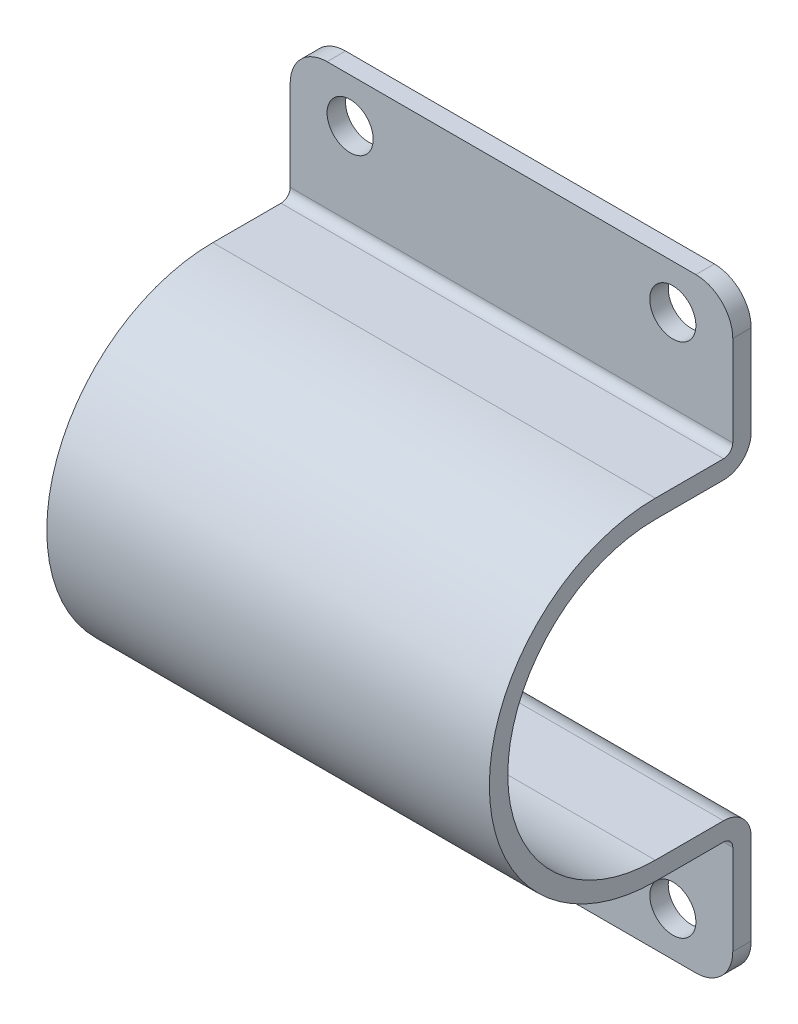
ISO-10303-21;
HEADER;
FILE_DESCRIPTION(('STEP AP214'),'2;1');
FILE_NAME('part.step','',(''),(''),'','','');
FILE_SCHEMA(('AUTOMOTIVE_DESIGN { 1 0 10303 214 1 1 1 1 }'));
ENDSEC;
DATA;
#1=APPLICATION_CONTEXT('core data for automotive mechanical design processes');
#2=APPLICATION_PROTOCOL_DEFINITION('international standard','automotive_design',2000,#1);
#3=PRODUCT_CONTEXT('',#1,'mechanical');
#4=PRODUCT('Part','Part','',(#3));
#5=PRODUCT_RELATED_PRODUCT_CATEGORY('part','',(#4));
#6=PRODUCT_DEFINITION_FORMATION('','',#4);
#7=PRODUCT_DEFINITION_CONTEXT('part definition',#1,'design');
#8=PRODUCT_DEFINITION('design','',#6,#7);
#9=PRODUCT_DEFINITION_SHAPE('','',#8);
#10=(LENGTH_UNIT() NAMED_UNIT(*) SI_UNIT(.MILLI.,.METRE.));
#11=(NAMED_UNIT(*) PLANE_ANGLE_UNIT() SI_UNIT($,.RADIAN.));
#12=(NAMED_UNIT(*) SI_UNIT($,.STERADIAN.) SOLID_ANGLE_UNIT());
#13=UNCERTAINTY_MEASURE_WITH_UNIT(LENGTH_MEASURE(1.E-05),#10,'distance_accuracy_value','');
#14=(GEOMETRIC_REPRESENTATION_CONTEXT(3) GLOBAL_UNCERTAINTY_ASSIGNED_CONTEXT((#13)) GLOBAL_UNIT_ASSIGNED_CONTEXT((#10,
#11,#12)) REPRESENTATION_CONTEXT('',''));
#15=CARTESIAN_POINT('',(0.,0.,0.));
#16=DIRECTION('',(0.,0.,1.));
#17=DIRECTION('',(1.,0.,0.));
#18=AXIS2_PLACEMENT_3D('',#15,#16,#17);
#19=CARTESIAN_POINT('',(240.,164.,10.));
#20=DIRECTION('',(0.,-1.,0.));
#21=DIRECTION('',(0.,0.,-1.));
#22=AXIS2_PLACEMENT_3D('',#19,#20,#21);
#23=PLANE('',#22);
#24=DIRECTION('',(-1.,0.,0.));
#25=VECTOR('',#24,1.);
#26=CARTESIAN_POINT('',(240.,164.,0.));
#27=LINE('',#26,#25);
#28=CARTESIAN_POINT('',(220.,164.,0.));
#29=VERTEX_POINT('',#28);
#30=CARTESIAN_POINT('',(20.,164.,0.));
#31=VERTEX_POINT('',#30);
#32=EDGE_CURVE('E234',#29,#31,#27,.T.);
#33=ORIENTED_EDGE('',*,*,#32,.T.);
#34=DIRECTION('',(0.,0.,1.));
#35=VECTOR('',#34,1.);
#36=CARTESIAN_POINT('',(20.,164.,10.));
#37=LINE('',#36,#35);
#38=CARTESIAN_POINT('',(20.,164.,10.));
#39=VERTEX_POINT('',#38);
#40=EDGE_CURVE('E324',#31,#39,#37,.T.);
#41=ORIENTED_EDGE('',*,*,#40,.T.);
#42=DIRECTION('',(-1.,0.,0.));
#43=VECTOR('',#42,1.);
#44=CARTESIAN_POINT('',(240.,164.,10.));
#45=LINE('',#44,#43);
#46=CARTESIAN_POINT('',(220.,164.,10.));
#47=VERTEX_POINT('',#46);
#48=EDGE_CURVE('E201',#47,#39,#45,.T.);
#49=ORIENTED_EDGE('',*,*,#48,.F.);
#50=DIRECTION('',(0.,0.,1.));
#51=VECTOR('',#50,1.);
#52=CARTESIAN_POINT('',(220.,164.,10.));
#53=LINE('',#52,#51);
#54=EDGE_CURVE('E63',#47,#29,#53,.F.);
#55=ORIENTED_EDGE('',*,*,#54,.T.);
#56=EDGE_LOOP('',(#33,#41,#49,#55));
#57=FACE_BOUND('',#56,.T.);
#58=ADVANCED_FACE('F43',(#57),#23,.F.);
#59=CARTESIAN_POINT('',(240.,95.,10.));
#60=DIRECTION('',(0.,0.,-1.));
#61=DIRECTION('',(-1.,0.,0.));
#62=AXIS2_PLACEMENT_3D('',#59,#60,#61);
#63=PLANE('',#62);
#64=CARTESIAN_POINT('',(207.5,140.,10.));
#65=DIRECTION('',(0.,0.,-1.));
#66=DIRECTION('',(-1.,0.,0.));
#67=AXIS2_PLACEMENT_3D('',#64,#65,#66);
#68=CIRCLE('',#67,12.5);
#69=CARTESIAN_POINT('',(195.,140.,10.));
#70=VERTEX_POINT('',#69);
#71=EDGE_CURVE('E633',#70,#70,#68,.T.);
#72=ORIENTED_EDGE('',*,*,#71,.T.);
#73=EDGE_LOOP('',(#72));
#74=FACE_BOUND('',#73,.T.);
#75=CARTESIAN_POINT('',(32.5,140.,10.));
#76=DIRECTION('',(0.,0.,-1.));
#77=DIRECTION('',(-1.,0.,0.));
#78=AXIS2_PLACEMENT_3D('',#75,#76,#77);
#79=CIRCLE('',#78,12.5);
#80=CARTESIAN_POINT('',(20.,140.,10.));
#81=VERTEX_POINT('',#80);
#82=EDGE_CURVE('E636',#81,#81,#79,.T.);
#83=ORIENTED_EDGE('',*,*,#82,.T.);
#84=EDGE_LOOP('',(#83));
#85=FACE_BOUND('',#84,.T.);
#86=ORIENTED_EDGE('',*,*,#48,.T.);
#87=CARTESIAN_POINT('',(20.,144.,10.));
#88=DIRECTION('',(0.,0.,-1.));
#89=DIRECTION('',(-1.,0.,0.));
#90=AXIS2_PLACEMENT_3D('',#87,#88,#89);
#91=CIRCLE('',#90,20.);
#92=CARTESIAN_POINT('',(0.,144.,10.));
#93=VERTEX_POINT('',#92);
#94=EDGE_CURVE('E329',#39,#93,#91,.F.);
#95=ORIENTED_EDGE('',*,*,#94,.T.);
#96=DIRECTION('',(0.,-1.,0.));
#97=VECTOR('',#96,1.);
#98=CARTESIAN_POINT('',(0.,95.,10.));
#99=LINE('',#98,#97);
#100=CARTESIAN_POINT('',(0.,95.,10.));
#101=VERTEX_POINT('',#100);
#102=EDGE_CURVE('E198',#93,#101,#99,.T.);
#103=ORIENTED_EDGE('',*,*,#102,.T.);
#104=DIRECTION('',(-1.,0.,0.));
#105=VECTOR('',#104,1.);
#106=CARTESIAN_POINT('',(240.,95.,10.));
#107=LINE('',#106,#105);
#108=CARTESIAN_POINT('',(240.,95.,10.));
#109=VERTEX_POINT('',#108);
#110=EDGE_CURVE('E194',#109,#101,#107,.T.);
#111=ORIENTED_EDGE('',*,*,#110,.F.);
#112=DIRECTION('',(0.,-1.,0.));
#113=VECTOR('',#112,1.);
#114=CARTESIAN_POINT('',(240.,95.,10.));
#115=LINE('',#114,#113);
#116=CARTESIAN_POINT('',(240.,144.,10.));
#117=VERTEX_POINT('',#116);
#118=EDGE_CURVE('E180',#117,#109,#115,.T.);
#119=ORIENTED_EDGE('',*,*,#118,.F.);
#120=CARTESIAN_POINT('',(220.,144.,10.));
#121=DIRECTION('',(0.,0.,-1.));
#122=DIRECTION('',(-1.,0.,0.));
#123=AXIS2_PLACEMENT_3D('',#120,#121,#122);
#124=CIRCLE('',#123,20.);
#125=EDGE_CURVE('E327',#117,#47,#124,.F.);
#126=ORIENTED_EDGE('',*,*,#125,.T.);
#127=EDGE_LOOP('',(#86,#95,#103,#111,#119,#126));
#128=FACE_BOUND('',#127,.T.);
#129=ADVANCED_FACE('F196',(#74,#85,#128),#63,.F.);
#130=CARTESIAN_POINT('',(240.,95.,15.));
#131=DIRECTION('',(-1.,0.,0.));
#132=DIRECTION('',(0.,0.,1.));
#133=AXIS2_PLACEMENT_3D('',#130,#131,#132);
#134=CYLINDRICAL_SURFACE('',#133,5.);
#135=CARTESIAN_POINT('',(0.,95.,15.));
#136=DIRECTION('',(-1.,0.,0.));
#137=DIRECTION('',(0.,0.,-1.));
#138=AXIS2_PLACEMENT_3D('',#135,#136,#137);
#139=CIRCLE('',#138,5.);
#140=CARTESIAN_POINT('',(0.,90.,15.));
#141=VERTEX_POINT('',#140);
#142=EDGE_CURVE('E236',#101,#141,#139,.T.);
#143=ORIENTED_EDGE('',*,*,#142,.T.);
#144=DIRECTION('',(-1.,0.,0.));
#145=VECTOR('',#144,1.);
#146=CARTESIAN_POINT('',(240.,90.,15.));
#147=LINE('',#146,#145);
#148=CARTESIAN_POINT('',(240.,90.,15.));
#149=VERTEX_POINT('',#148);
#150=EDGE_CURVE('E202',#149,#141,#147,.T.);
#151=ORIENTED_EDGE('',*,*,#150,.F.);
#152=CARTESIAN_POINT('',(240.,95.,15.));
#153=DIRECTION('',(-1.,0.,0.));
#154=DIRECTION('',(0.,0.,-1.));
#155=AXIS2_PLACEMENT_3D('',#152,#153,#154);
#156=CIRCLE('',#155,5.);
#157=EDGE_CURVE('E185',#109,#149,#156,.T.);
#158=ORIENTED_EDGE('',*,*,#157,.F.);
#159=ORIENTED_EDGE('',*,*,#110,.T.);
#160=EDGE_LOOP('',(#143,#151,#158,#159));
#161=FACE_BOUND('',#160,.T.);
#162=ADVANCED_FACE('F204',(#161),#134,.F.);
#163=CARTESIAN_POINT('',(240.,90.,52.));
#164=DIRECTION('',(0.,-1.,0.));
#165=DIRECTION('',(0.,0.,-1.));
#166=AXIS2_PLACEMENT_3D('',#163,#164,#165);
#167=PLANE('',#166);
#168=DIRECTION('',(0.,0.,1.));
#169=VECTOR('',#168,1.);
#170=CARTESIAN_POINT('',(0.,90.,52.));
#171=LINE('',#170,#169);
#172=CARTESIAN_POINT('',(0.,90.,52.));
#173=VERTEX_POINT('',#172);
#174=EDGE_CURVE('E239',#141,#173,#171,.T.);
#175=ORIENTED_EDGE('',*,*,#174,.T.);
#176=DIRECTION('',(-1.,0.,0.));
#177=VECTOR('',#176,1.);
#178=CARTESIAN_POINT('',(240.,90.,52.));
#179=LINE('',#178,#177);
#180=CARTESIAN_POINT('',(240.,90.,52.));
#181=VERTEX_POINT('',#180);
#182=EDGE_CURVE('E297',#181,#173,#179,.T.);
#183=ORIENTED_EDGE('',*,*,#182,.F.);
#184=DIRECTION('',(0.,0.,1.));
#185=VECTOR('',#184,1.);
#186=CARTESIAN_POINT('',(240.,90.,52.));
#187=LINE('',#186,#185);
#188=EDGE_CURVE('E207',#149,#181,#187,.T.);
#189=ORIENTED_EDGE('',*,*,#188,.F.);
#190=ORIENTED_EDGE('',*,*,#150,.T.);
#191=EDGE_LOOP('',(#175,#183,#189,#190));
#192=FACE_BOUND('',#191,.T.);
#193=ADVANCED_FACE('F347',(#192),#167,.F.);
#194=CARTESIAN_POINT('',(240.,0.,52.));
#195=DIRECTION('',(-1.,0.,0.));
#196=DIRECTION('',(0.,0.,1.));
#197=AXIS2_PLACEMENT_3D('',#194,#195,#196);
#198=CYLINDRICAL_SURFACE('',#197,90.);
#199=CARTESIAN_POINT('',(0.,0.,52.));
#200=DIRECTION('',(1.,0.,0.));
#201=DIRECTION('',(0.,0.,1.));
#202=AXIS2_PLACEMENT_3D('',#199,#200,#201);
#203=CIRCLE('',#202,90.);
#204=CARTESIAN_POINT('',(0.,-90.,52.));
#205=VERTEX_POINT('',#204);
#206=EDGE_CURVE('E241',#173,#205,#203,.T.);
#207=ORIENTED_EDGE('',*,*,#206,.T.);
#208=DIRECTION('',(-1.,0.,0.));
#209=VECTOR('',#208,1.);
#210=CARTESIAN_POINT('',(240.,-90.,52.));
#211=LINE('',#210,#209);
#212=CARTESIAN_POINT('',(240.,-90.,52.));
#213=VERTEX_POINT('',#212);
#214=EDGE_CURVE('E294',#213,#205,#211,.T.);
#215=ORIENTED_EDGE('',*,*,#214,.F.);
#216=CARTESIAN_POINT('',(240.,0.,52.));
#217=DIRECTION('',(1.,0.,0.));
#218=DIRECTION('',(0.,0.,1.));
#219=AXIS2_PLACEMENT_3D('',#216,#217,#218);
#220=CIRCLE('',#219,90.);
#221=EDGE_CURVE('E209',#181,#213,#220,.T.);
#222=ORIENTED_EDGE('',*,*,#221,.F.);
#223=ORIENTED_EDGE('',*,*,#182,.T.);
#224=EDGE_LOOP('',(#207,#215,#222,#223));
#225=FACE_BOUND('',#224,.T.);
#226=ADVANCED_FACE('F354',(#225),#198,.T.);
#227=CARTESIAN_POINT('',(240.,-90.,15.));
#228=DIRECTION('',(0.,1.,0.));
#229=DIRECTION('',(0.,0.,1.));
#230=AXIS2_PLACEMENT_3D('',#227,#228,#229);
#231=PLANE('',#230);
#232=DIRECTION('',(0.,0.,-1.));
#233=VECTOR('',#232,1.);
#234=CARTESIAN_POINT('',(0.,-90.,15.));
#235=LINE('',#234,#233);
#236=CARTESIAN_POINT('',(0.,-90.,15.));
#237=VERTEX_POINT('',#236);
#238=EDGE_CURVE('E243',#205,#237,#235,.T.);
#239=ORIENTED_EDGE('',*,*,#238,.T.);
#240=DIRECTION('',(-1.,0.,0.));
#241=VECTOR('',#240,1.);
#242=CARTESIAN_POINT('',(240.,-90.,15.));
#243=LINE('',#242,#241);
#244=CARTESIAN_POINT('',(240.,-90.,15.));
#245=VERTEX_POINT('',#244);
#246=EDGE_CURVE('E291',#245,#237,#243,.T.);
#247=ORIENTED_EDGE('',*,*,#246,.F.);
#248=DIRECTION('',(0.,0.,-1.));
#249=VECTOR('',#248,1.);
#250=CARTESIAN_POINT('',(240.,-90.,15.));
#251=LINE('',#250,#249);
#252=EDGE_CURVE('E214',#213,#245,#251,.T.);
#253=ORIENTED_EDGE('',*,*,#252,.F.);
#254=ORIENTED_EDGE('',*,*,#214,.T.);
#255=EDGE_LOOP('',(#239,#247,#253,#254));
#256=FACE_BOUND('',#255,.T.);
#257=ADVANCED_FACE('F357',(#256),#231,.F.);
#258=CARTESIAN_POINT('',(240.,-95.,15.));
#259=DIRECTION('',(-1.,0.,0.));
#260=DIRECTION('',(0.,0.,1.));
#261=AXIS2_PLACEMENT_3D('',#258,#259,#260);
#262=CYLINDRICAL_SURFACE('',#261,5.);
#263=CARTESIAN_POINT('',(0.,-95.,15.));
#264=DIRECTION('',(-1.,0.,0.));
#265=DIRECTION('',(0.,0.,-1.));
#266=AXIS2_PLACEMENT_3D('',#263,#264,#265);
#267=CIRCLE('',#266,5.);
#268=CARTESIAN_POINT('',(0.,-95.,10.));
#269=VERTEX_POINT('',#268);
#270=EDGE_CURVE('E245',#237,#269,#267,.T.);
#271=ORIENTED_EDGE('',*,*,#270,.T.);
#272=DIRECTION('',(-1.,0.,0.));
#273=VECTOR('',#272,1.);
#274=CARTESIAN_POINT('',(240.,-95.,10.));
#275=LINE('',#274,#273);
#276=CARTESIAN_POINT('',(240.,-95.,10.));
#277=VERTEX_POINT('',#276);
#278=EDGE_CURVE('E288',#277,#269,#275,.T.);
#279=ORIENTED_EDGE('',*,*,#278,.F.);
#280=CARTESIAN_POINT('',(240.,-95.,15.));
#281=DIRECTION('',(-1.,0.,0.));
#282=DIRECTION('',(0.,0.,-1.));
#283=AXIS2_PLACEMENT_3D('',#280,#281,#282);
#284=CIRCLE('',#283,5.);
#285=EDGE_CURVE('E216',#245,#277,#284,.T.);
#286=ORIENTED_EDGE('',*,*,#285,.F.);
#287=ORIENTED_EDGE('',*,*,#246,.T.);
#288=EDGE_LOOP('',(#271,#279,#286,#287));
#289=FACE_BOUND('',#288,.T.);
#290=ADVANCED_FACE('F362',(#289),#262,.F.);
#291=CARTESIAN_POINT('',(240.,-164.,10.));
#292=DIRECTION('',(0.,0.,-1.));
#293=DIRECTION('',(-1.,0.,0.));
#294=AXIS2_PLACEMENT_3D('',#291,#292,#293);
#295=PLANE('',#294);
#296=CARTESIAN_POINT('',(32.5,-140.,10.));
#297=DIRECTION('',(0.,0.,-1.));
#298=DIRECTION('',(-1.,0.,0.));
#299=AXIS2_PLACEMENT_3D('',#296,#297,#298);
#300=CIRCLE('',#299,12.5);
#301=CARTESIAN_POINT('',(20.,-140.,10.));
#302=VERTEX_POINT('',#301);
#303=EDGE_CURVE('E237',#302,#302,#300,.T.);
#304=ORIENTED_EDGE('',*,*,#303,.T.);
#305=EDGE_LOOP('',(#304));
#306=FACE_BOUND('',#305,.T.);
#307=CARTESIAN_POINT('',(207.5,-140.,10.));
#308=DIRECTION('',(0.,0.,-1.));
#309=DIRECTION('',(-1.,0.,0.));
#310=AXIS2_PLACEMENT_3D('',#307,#308,#309);
#311=CIRCLE('',#310,12.5);
#312=CARTESIAN_POINT('',(195.,-140.,10.));
#313=VERTEX_POINT('',#312);
#314=EDGE_CURVE('E631',#313,#313,#311,.T.);
#315=ORIENTED_EDGE('',*,*,#314,.T.);
#316=EDGE_LOOP('',(#315));
#317=FACE_BOUND('',#316,.T.);
#318=DIRECTION('',(0.,-1.,0.));
#319=VECTOR('',#318,1.);
#320=CARTESIAN_POINT('',(0.,-164.,10.));
#321=LINE('',#320,#319);
#322=CARTESIAN_POINT('',(0.,-144.,10.));
#323=VERTEX_POINT('',#322);
#324=EDGE_CURVE('E247',#269,#323,#321,.T.);
#325=ORIENTED_EDGE('',*,*,#324,.T.);
#326=CARTESIAN_POINT('',(20.,-144.,10.));
#327=DIRECTION('',(0.,0.,-1.));
#328=DIRECTION('',(-1.,0.,0.));
#329=AXIS2_PLACEMENT_3D('',#326,#327,#328);
#330=CIRCLE('',#329,20.);
#331=CARTESIAN_POINT('',(20.,-164.,10.));
#332=VERTEX_POINT('',#331);
#333=EDGE_CURVE('E317',#323,#332,#330,.F.);
#334=ORIENTED_EDGE('',*,*,#333,.T.);
#335=DIRECTION('',(-1.,0.,0.));
#336=VECTOR('',#335,1.);
#337=CARTESIAN_POINT('',(240.,-164.,10.));
#338=LINE('',#337,#336);
#339=CARTESIAN_POINT('',(220.,-164.,10.));
#340=VERTEX_POINT('',#339);
#341=EDGE_CURVE('E285',#340,#332,#338,.T.);
#342=ORIENTED_EDGE('',*,*,#341,.F.);
#343=CARTESIAN_POINT('',(220.,-144.,10.));
#344=DIRECTION('',(0.,0.,-1.));
#345=DIRECTION('',(-1.,0.,0.));
#346=AXIS2_PLACEMENT_3D('',#343,#344,#345);
#347=CIRCLE('',#346,20.);
#348=CARTESIAN_POINT('',(240.,-144.,10.));
#349=VERTEX_POINT('',#348);
#350=EDGE_CURVE('E315',#340,#349,#347,.F.);
#351=ORIENTED_EDGE('',*,*,#350,.T.);
#352=DIRECTION('',(0.,-1.,0.));
#353=VECTOR('',#352,1.);
#354=CARTESIAN_POINT('',(240.,-164.,10.));
#355=LINE('',#354,#353);
#356=EDGE_CURVE('E218',#277,#349,#355,.T.);
#357=ORIENTED_EDGE('',*,*,#356,.F.);
#358=ORIENTED_EDGE('',*,*,#278,.T.);
#359=EDGE_LOOP('',(#325,#334,#342,#351,#357,#358));
#360=FACE_BOUND('',#359,.T.);
#361=ADVANCED_FACE('F566',(#306,#317,#360),#295,.F.);
#362=CARTESIAN_POINT('',(240.,-164.,0.));
#363=DIRECTION('',(0.,1.,0.));
#364=DIRECTION('',(0.,0.,1.));
#365=AXIS2_PLACEMENT_3D('',#362,#363,#364);
#366=PLANE('',#365);
#367=ORIENTED_EDGE('',*,*,#341,.T.);
#368=DIRECTION('',(0.,0.,-1.));
#369=VECTOR('',#368,1.);
#370=CARTESIAN_POINT('',(20.,-164.,0.));
#371=LINE('',#370,#369);
#372=CARTESIAN_POINT('',(20.,-164.,0.));
#373=VERTEX_POINT('',#372);
#374=EDGE_CURVE('E304',#332,#373,#371,.T.);
#375=ORIENTED_EDGE('',*,*,#374,.T.);
#376=DIRECTION('',(-1.,0.,0.));
#377=VECTOR('',#376,1.);
#378=CARTESIAN_POINT('',(240.,-164.,0.));
#379=LINE('',#378,#377);
#380=CARTESIAN_POINT('',(220.,-164.,0.));
#381=VERTEX_POINT('',#380);
#382=EDGE_CURVE('E282',#381,#373,#379,.T.);
#383=ORIENTED_EDGE('',*,*,#382,.F.);
#384=DIRECTION('',(0.,0.,-1.));
#385=VECTOR('',#384,1.);
#386=CARTESIAN_POINT('',(220.,-164.,0.));
#387=LINE('',#386,#385);
#388=EDGE_CURVE('E302',#381,#340,#387,.F.);
#389=ORIENTED_EDGE('',*,*,#388,.T.);
#390=EDGE_LOOP('',(#367,#375,#383,#389));
#391=FACE_BOUND('',#390,.T.);
#392=ADVANCED_FACE('F376',(#391),#366,.F.);
#393=CARTESIAN_POINT('',(240.,-95.0000000000001,0.));
#394=DIRECTION('',(0.,0.,1.));
#395=DIRECTION('',(0.,-1.,0.));
#396=AXIS2_PLACEMENT_3D('',#393,#394,#395);
#397=PLANE('',#396);
#398=CARTESIAN_POINT('',(32.5,-140.,0.));
#399=DIRECTION('',(0.,0.,1.));
#400=DIRECTION('',(-1.,0.,0.));
#401=AXIS2_PLACEMENT_3D('',#398,#399,#400);
#402=CIRCLE('',#401,12.5);
#403=CARTESIAN_POINT('',(20.,-140.,0.));
#404=VERTEX_POINT('',#403);
#405=EDGE_CURVE('E645',#404,#404,#402,.T.);
#406=ORIENTED_EDGE('',*,*,#405,.T.);
#407=EDGE_LOOP('',(#406));
#408=FACE_BOUND('',#407,.T.);
#409=CARTESIAN_POINT('',(207.5,-140.,0.));
#410=DIRECTION('',(0.,0.,1.));
#411=DIRECTION('',(-1.,0.,0.));
#412=AXIS2_PLACEMENT_3D('',#409,#410,#411);
#413=CIRCLE('',#412,12.5);
#414=CARTESIAN_POINT('',(195.,-140.,0.));
#415=VERTEX_POINT('',#414);
#416=EDGE_CURVE('E648',#415,#415,#413,.T.);
#417=ORIENTED_EDGE('',*,*,#416,.T.);
#418=EDGE_LOOP('',(#417));
#419=FACE_BOUND('',#418,.T.);
#420=ORIENTED_EDGE('',*,*,#382,.T.);
#421=CARTESIAN_POINT('',(20.,-144.,0.));
#422=DIRECTION('',(0.,0.,1.));
#423=DIRECTION('',(0.,-1.,0.));
#424=AXIS2_PLACEMENT_3D('',#421,#422,#423);
#425=CIRCLE('',#424,20.);
#426=CARTESIAN_POINT('',(0.,-144.,0.));
#427=VERTEX_POINT('',#426);
#428=EDGE_CURVE('E309',#373,#427,#425,.F.);
#429=ORIENTED_EDGE('',*,*,#428,.T.);
#430=DIRECTION('',(0.,1.,0.));
#431=VECTOR('',#430,1.);
#432=CARTESIAN_POINT('',(0.,-95.0000000000001,0.));
#433=LINE('',#432,#431);
#434=CARTESIAN_POINT('',(0.,-95.0000000000001,0.));
#435=VERTEX_POINT('',#434);
#436=EDGE_CURVE('E250',#427,#435,#433,.T.);
#437=ORIENTED_EDGE('',*,*,#436,.T.);
#438=DIRECTION('',(-1.,0.,0.));
#439=VECTOR('',#438,1.);
#440=CARTESIAN_POINT('',(240.,-95.0000000000001,0.));
#441=LINE('',#440,#439);
#442=CARTESIAN_POINT('',(240.,-95.0000000000001,0.));
#443=VERTEX_POINT('',#442);
#444=EDGE_CURVE('E279',#443,#435,#441,.T.);
#445=ORIENTED_EDGE('',*,*,#444,.F.);
#446=DIRECTION('',(0.,1.,0.));
#447=VECTOR('',#446,1.);
#448=CARTESIAN_POINT('',(240.,-95.0000000000001,0.));
#449=LINE('',#448,#447);
#450=CARTESIAN_POINT('',(240.,-144.,0.));
#451=VERTEX_POINT('',#450);
#452=EDGE_CURVE('E220',#451,#443,#449,.T.);
#453=ORIENTED_EDGE('',*,*,#452,.F.);
#454=CARTESIAN_POINT('',(220.,-144.,0.));
#455=DIRECTION('',(0.,0.,1.));
#456=DIRECTION('',(0.,-1.,0.));
#457=AXIS2_PLACEMENT_3D('',#454,#455,#456);
#458=CIRCLE('',#457,20.);
#459=EDGE_CURVE('E307',#451,#381,#458,.F.);
#460=ORIENTED_EDGE('',*,*,#459,.T.);
#461=EDGE_LOOP('',(#420,#429,#437,#445,#453,#460));
#462=FACE_BOUND('',#461,.T.);
#463=ADVANCED_FACE('F373',(#408,#419,#462),#397,.F.);
#464=CARTESIAN_POINT('',(240.,-95.,15.));
#465=DIRECTION('',(-1.,0.,0.));
#466=DIRECTION('',(0.,0.,1.));
#467=AXIS2_PLACEMENT_3D('',#464,#465,#466);
#468=CYLINDRICAL_SURFACE('',#467,15.);
#469=CARTESIAN_POINT('',(0.,-95.,15.));
#470=DIRECTION('',(1.,0.,0.));
#471=DIRECTION('',(0.,0.,1.));
#472=AXIS2_PLACEMENT_3D('',#469,#470,#471);
#473=CIRCLE('',#472,15.);
#474=CARTESIAN_POINT('',(0.,-80.,15.0000000000001));
#475=VERTEX_POINT('',#474);
#476=EDGE_CURVE('E252',#435,#475,#473,.T.);
#477=ORIENTED_EDGE('',*,*,#476,.T.);
#478=DIRECTION('',(-1.,0.,0.));
#479=VECTOR('',#478,1.);
#480=CARTESIAN_POINT('',(240.,-80.,15.0000000000001));
#481=LINE('',#480,#479);
#482=CARTESIAN_POINT('',(240.,-80.,15.0000000000001));
#483=VERTEX_POINT('',#482);
#484=EDGE_CURVE('E276',#483,#475,#481,.T.);
#485=ORIENTED_EDGE('',*,*,#484,.F.);
#486=CARTESIAN_POINT('',(240.,-95.,15.));
#487=DIRECTION('',(1.,0.,0.));
#488=DIRECTION('',(0.,0.,1.));
#489=AXIS2_PLACEMENT_3D('',#486,#487,#488);
#490=CIRCLE('',#489,15.);
#491=EDGE_CURVE('E222',#443,#483,#490,.T.);
#492=ORIENTED_EDGE('',*,*,#491,.F.);
#493=ORIENTED_EDGE('',*,*,#444,.T.);
#494=EDGE_LOOP('',(#477,#485,#492,#493));
#495=FACE_BOUND('',#494,.T.);
#496=ADVANCED_FACE('F389',(#495),#468,.T.);
#497=CARTESIAN_POINT('',(240.,-80.,52.));
#498=DIRECTION('',(0.,-1.,0.));
#499=DIRECTION('',(0.,0.,-1.));
#500=AXIS2_PLACEMENT_3D('',#497,#498,#499);
#501=PLANE('',#500);
#502=DIRECTION('',(0.,0.,1.));
#503=VECTOR('',#502,1.);
#504=CARTESIAN_POINT('',(0.,-80.,52.));
#505=LINE('',#504,#503);
#506=CARTESIAN_POINT('',(0.,-80.,52.));
#507=VERTEX_POINT('',#506);
#508=EDGE_CURVE('E254',#475,#507,#505,.T.);
#509=ORIENTED_EDGE('',*,*,#508,.T.);
#510=DIRECTION('',(-1.,0.,0.));
#511=VECTOR('',#510,1.);
#512=CARTESIAN_POINT('',(240.,-80.,52.));
#513=LINE('',#512,#511);
#514=CARTESIAN_POINT('',(240.,-80.,52.));
#515=VERTEX_POINT('',#514);
#516=EDGE_CURVE('E273',#515,#507,#513,.T.);
#517=ORIENTED_EDGE('',*,*,#516,.F.);
#518=DIRECTION('',(0.,0.,1.));
#519=VECTOR('',#518,1.);
#520=CARTESIAN_POINT('',(240.,-80.,52.));
#521=LINE('',#520,#519);
#522=EDGE_CURVE('E224',#483,#515,#521,.T.);
#523=ORIENTED_EDGE('',*,*,#522,.F.);
#524=ORIENTED_EDGE('',*,*,#484,.T.);
#525=EDGE_LOOP('',(#509,#517,#523,#524));
#526=FACE_BOUND('',#525,.T.);
#527=ADVANCED_FACE('F393',(#526),#501,.F.);
#528=CARTESIAN_POINT('',(240.,0.,52.));
#529=DIRECTION('',(-1.,0.,0.));
#530=DIRECTION('',(0.,0.,1.));
#531=AXIS2_PLACEMENT_3D('',#528,#529,#530);
#532=CYLINDRICAL_SURFACE('',#531,80.);
#533=CARTESIAN_POINT('',(0.,0.,52.));
#534=DIRECTION('',(-1.,0.,0.));
#535=DIRECTION('',(0.,0.,-1.));
#536=AXIS2_PLACEMENT_3D('',#533,#534,#535);
#537=CIRCLE('',#536,80.);
#538=CARTESIAN_POINT('',(0.,80.,52.));
#539=VERTEX_POINT('',#538);
#540=EDGE_CURVE('E256',#507,#539,#537,.T.);
#541=ORIENTED_EDGE('',*,*,#540,.T.);
#542=DIRECTION('',(-1.,0.,0.));
#543=VECTOR('',#542,1.);
#544=CARTESIAN_POINT('',(240.,80.,52.));
#545=LINE('',#544,#543);
#546=CARTESIAN_POINT('',(240.,80.,52.));
#547=VERTEX_POINT('',#546);
#548=EDGE_CURVE('E270',#547,#539,#545,.T.);
#549=ORIENTED_EDGE('',*,*,#548,.F.);
#550=CARTESIAN_POINT('',(240.,0.,52.));
#551=DIRECTION('',(-1.,0.,0.));
#552=DIRECTION('',(0.,0.,-1.));
#553=AXIS2_PLACEMENT_3D('',#550,#551,#552);
#554=CIRCLE('',#553,80.);
#555=EDGE_CURVE('E226',#515,#547,#554,.T.);
#556=ORIENTED_EDGE('',*,*,#555,.F.);
#557=ORIENTED_EDGE('',*,*,#516,.T.);
#558=EDGE_LOOP('',(#541,#549,#556,#557));
#559=FACE_BOUND('',#558,.T.);
#560=ADVANCED_FACE('F400',(#559),#532,.F.);
#561=CARTESIAN_POINT('',(240.,80.,15.0000000000001));
#562=DIRECTION('',(0.,1.,0.));
#563=DIRECTION('',(0.,0.,1.));
#564=AXIS2_PLACEMENT_3D('',#561,#562,#563);
#565=PLANE('',#564);
#566=DIRECTION('',(0.,0.,-1.));
#567=VECTOR('',#566,1.);
#568=CARTESIAN_POINT('',(0.,80.,15.0000000000001));
#569=LINE('',#568,#567);
#570=CARTESIAN_POINT('',(0.,80.,15.0000000000001));
#571=VERTEX_POINT('',#570);
#572=EDGE_CURVE('E258',#539,#571,#569,.T.);
#573=ORIENTED_EDGE('',*,*,#572,.T.);
#574=DIRECTION('',(-1.,0.,0.));
#575=VECTOR('',#574,1.);
#576=CARTESIAN_POINT('',(240.,80.,15.0000000000001));
#577=LINE('',#576,#575);
#578=CARTESIAN_POINT('',(240.,80.,15.0000000000001));
#579=VERTEX_POINT('',#578);
#580=EDGE_CURVE('E267',#579,#571,#577,.T.);
#581=ORIENTED_EDGE('',*,*,#580,.F.);
#582=DIRECTION('',(0.,0.,-1.));
#583=VECTOR('',#582,1.);
#584=CARTESIAN_POINT('',(240.,80.,15.0000000000001));
#585=LINE('',#584,#583);
#586=EDGE_CURVE('E228',#547,#579,#585,.T.);
#587=ORIENTED_EDGE('',*,*,#586,.F.);
#588=ORIENTED_EDGE('',*,*,#548,.T.);
#589=EDGE_LOOP('',(#573,#581,#587,#588));
#590=FACE_BOUND('',#589,.T.);
#591=ADVANCED_FACE('F403',(#590),#565,.F.);
#592=CARTESIAN_POINT('',(240.,95.,15.));
#593=DIRECTION('',(-1.,0.,0.));
#594=DIRECTION('',(0.,0.,1.));
#595=AXIS2_PLACEMENT_3D('',#592,#593,#594);
#596=CYLINDRICAL_SURFACE('',#595,15.);
#597=CARTESIAN_POINT('',(0.,95.,15.));
#598=DIRECTION('',(1.,0.,0.));
#599=DIRECTION('',(0.,0.,1.));
#600=AXIS2_PLACEMENT_3D('',#597,#598,#599);
#601=CIRCLE('',#600,15.);
#602=CARTESIAN_POINT('',(0.,95.0000000000001,0.));
#603=VERTEX_POINT('',#602);
#604=EDGE_CURVE('E260',#571,#603,#601,.T.);
#605=ORIENTED_EDGE('',*,*,#604,.T.);
#606=DIRECTION('',(-1.,0.,0.));
#607=VECTOR('',#606,1.);
#608=CARTESIAN_POINT('',(240.,95.0000000000001,0.));
#609=LINE('',#608,#607);
#610=CARTESIAN_POINT('',(240.,95.0000000000001,0.));
#611=VERTEX_POINT('',#610);
#612=EDGE_CURVE('E264',#611,#603,#609,.T.);
#613=ORIENTED_EDGE('',*,*,#612,.F.);
#614=CARTESIAN_POINT('',(240.,95.,15.));
#615=DIRECTION('',(1.,0.,0.));
#616=DIRECTION('',(0.,0.,1.));
#617=AXIS2_PLACEMENT_3D('',#614,#615,#616);
#618=CIRCLE('',#617,15.);
#619=EDGE_CURVE('E230',#579,#611,#618,.T.);
#620=ORIENTED_EDGE('',*,*,#619,.F.);
#621=ORIENTED_EDGE('',*,*,#580,.T.);
#622=EDGE_LOOP('',(#605,#613,#620,#621));
#623=FACE_BOUND('',#622,.T.);
#624=ADVANCED_FACE('F406',(#623),#596,.T.);
#625=CARTESIAN_POINT('',(240.,164.,0.));
#626=DIRECTION('',(0.,0.,1.));
#627=DIRECTION('',(0.,-1.,0.));
#628=AXIS2_PLACEMENT_3D('',#625,#626,#627);
#629=PLANE('',#628);
#630=CARTESIAN_POINT('',(207.5,140.,0.));
#631=DIRECTION('',(0.,0.,1.));
#632=DIRECTION('',(1.,0.,0.));
#633=AXIS2_PLACEMENT_3D('',#630,#631,#632);
#634=CIRCLE('',#633,12.5);
#635=CARTESIAN_POINT('',(220.,140.,0.));
#636=VERTEX_POINT('',#635);
#637=EDGE_CURVE('E644',#636,#636,#634,.T.);
#638=ORIENTED_EDGE('',*,*,#637,.T.);
#639=EDGE_LOOP('',(#638));
#640=FACE_BOUND('',#639,.T.);
#641=CARTESIAN_POINT('',(32.5,140.,0.));
#642=DIRECTION('',(0.,0.,1.));
#643=DIRECTION('',(1.,0.,0.));
#644=AXIS2_PLACEMENT_3D('',#641,#642,#643);
#645=CIRCLE('',#644,12.5);
#646=CARTESIAN_POINT('',(45.,140.,0.));
#647=VERTEX_POINT('',#646);
#648=EDGE_CURVE('E641',#647,#647,#645,.T.);
#649=ORIENTED_EDGE('',*,*,#648,.T.);
#650=EDGE_LOOP('',(#649));
#651=FACE_BOUND('',#650,.T.);
#652=DIRECTION('',(0.,1.,0.));
#653=VECTOR('',#652,1.);
#654=CARTESIAN_POINT('',(0.,164.,0.));
#655=LINE('',#654,#653);
#656=CARTESIAN_POINT('',(0.,144.,0.));
#657=VERTEX_POINT('',#656);
#658=EDGE_CURVE('E191',#603,#657,#655,.T.);
#659=ORIENTED_EDGE('',*,*,#658,.T.);
#660=CARTESIAN_POINT('',(20.,144.,0.));
#661=DIRECTION('',(0.,0.,1.));
#662=DIRECTION('',(0.,-1.,0.));
#663=AXIS2_PLACEMENT_3D('',#660,#661,#662);
#664=CIRCLE('',#663,20.);
#665=EDGE_CURVE('E11',#657,#31,#664,.F.);
#666=ORIENTED_EDGE('',*,*,#665,.T.);
#667=ORIENTED_EDGE('',*,*,#32,.F.);
#668=CARTESIAN_POINT('',(220.,144.,0.));
#669=DIRECTION('',(0.,0.,1.));
#670=DIRECTION('',(0.,-1.,0.));
#671=AXIS2_PLACEMENT_3D('',#668,#669,#670);
#672=CIRCLE('',#671,20.);
#673=CARTESIAN_POINT('',(240.,144.,0.));
#674=VERTEX_POINT('',#673);
#675=EDGE_CURVE('E51',#29,#674,#672,.F.);
#676=ORIENTED_EDGE('',*,*,#675,.T.);
#677=DIRECTION('',(0.,1.,0.));
#678=VECTOR('',#677,1.);
#679=CARTESIAN_POINT('',(240.,164.,0.));
#680=LINE('',#679,#678);
#681=EDGE_CURVE('E232',#611,#674,#680,.T.);
#682=ORIENTED_EDGE('',*,*,#681,.F.);
#683=ORIENTED_EDGE('',*,*,#612,.T.);
#684=EDGE_LOOP('',(#659,#666,#667,#676,#682,#683));
#685=FACE_BOUND('',#684,.T.);
#686=ADVANCED_FACE('F332',(#640,#651,#685),#629,.F.);
#687=CARTESIAN_POINT('',(240.,95.,15.));
#688=DIRECTION('',(-1.,0.,0.));
#689=DIRECTION('',(0.,0.,1.));
#690=AXIS2_PLACEMENT_3D('',#687,#688,#689);
#691=PLANE('',#690);
#692=ORIENTED_EDGE('',*,*,#356,.T.);
#693=DIRECTION('',(0.,0.,-1.));
#694=VECTOR('',#693,1.);
#695=CARTESIAN_POINT('',(240.,-144.,15.));
#696=LINE('',#695,#694);
#697=EDGE_CURVE('E320',#349,#451,#696,.T.);
#698=ORIENTED_EDGE('',*,*,#697,.T.);
#699=ORIENTED_EDGE('',*,*,#452,.T.);
#700=ORIENTED_EDGE('',*,*,#491,.T.);
#701=ORIENTED_EDGE('',*,*,#522,.T.);
#702=ORIENTED_EDGE('',*,*,#555,.T.);
#703=ORIENTED_EDGE('',*,*,#586,.T.);
#704=ORIENTED_EDGE('',*,*,#619,.T.);
#705=ORIENTED_EDGE('',*,*,#681,.T.);
#706=DIRECTION('',(0.,0.,1.));
#707=VECTOR('',#706,1.);
#708=CARTESIAN_POINT('',(240.,144.,15.));
#709=LINE('',#708,#707);
#710=EDGE_CURVE('E189',#674,#117,#709,.T.);
#711=ORIENTED_EDGE('',*,*,#710,.T.);
#712=ORIENTED_EDGE('',*,*,#118,.T.);
#713=ORIENTED_EDGE('',*,*,#157,.T.);
#714=ORIENTED_EDGE('',*,*,#188,.T.);
#715=ORIENTED_EDGE('',*,*,#221,.T.);
#716=ORIENTED_EDGE('',*,*,#252,.T.);
#717=ORIENTED_EDGE('',*,*,#285,.T.);
#718=EDGE_LOOP('',(#692,#698,#699,#700,#701,#702,#703,#704,#705,#711,#712,#713,#714,#715,#716,#717));
#719=FACE_BOUND('',#718,.T.);
#720=ADVANCED_FACE('F183',(#719),#691,.F.);
#721=CARTESIAN_POINT('',(0.,95.,15.));
#722=DIRECTION('',(-1.,0.,0.));
#723=DIRECTION('',(0.,0.,1.));
#724=AXIS2_PLACEMENT_3D('',#721,#722,#723);
#725=PLANE('',#724);
#726=ORIENTED_EDGE('',*,*,#436,.F.);
#727=DIRECTION('',(0.,0.,-1.));
#728=VECTOR('',#727,1.);
#729=CARTESIAN_POINT('',(0.,-144.,10.));
#730=LINE('',#729,#728);
#731=EDGE_CURVE('E313',#427,#323,#730,.F.);
#732=ORIENTED_EDGE('',*,*,#731,.T.);
#733=ORIENTED_EDGE('',*,*,#324,.F.);
#734=ORIENTED_EDGE('',*,*,#270,.F.);
#735=ORIENTED_EDGE('',*,*,#238,.F.);
#736=ORIENTED_EDGE('',*,*,#206,.F.);
#737=ORIENTED_EDGE('',*,*,#174,.F.);
#738=ORIENTED_EDGE('',*,*,#142,.F.);
#739=ORIENTED_EDGE('',*,*,#102,.F.);
#740=DIRECTION('',(0.,0.,1.));
#741=VECTOR('',#740,1.);
#742=CARTESIAN_POINT('',(0.,144.,0.));
#743=LINE('',#742,#741);
#744=EDGE_CURVE('E311',#93,#657,#743,.F.);
#745=ORIENTED_EDGE('',*,*,#744,.T.);
#746=ORIENTED_EDGE('',*,*,#658,.F.);
#747=ORIENTED_EDGE('',*,*,#604,.F.);
#748=ORIENTED_EDGE('',*,*,#572,.F.);
#749=ORIENTED_EDGE('',*,*,#540,.F.);
#750=ORIENTED_EDGE('',*,*,#508,.F.);
#751=ORIENTED_EDGE('',*,*,#476,.F.);
#752=EDGE_LOOP('',(#726,#732,#733,#734,#735,#736,#737,#738,#739,#745,#746,#747,#748,#749,#750,#751));
#753=FACE_BOUND('',#752,.T.);
#754=ADVANCED_FACE('F342',(#753),#725,.T.);
#755=CARTESIAN_POINT('',(32.5,140.,0.));
#756=DIRECTION('',(0.,0.,1.));
#757=DIRECTION('',(1.,0.,0.));
#758=AXIS2_PLACEMENT_3D('',#755,#756,#757);
#759=CYLINDRICAL_SURFACE('',#758,12.5);
#760=ORIENTED_EDGE('',*,*,#648,.F.);
#761=EDGE_LOOP('',(#760));
#762=FACE_BOUND('',#761,.T.);
#763=ORIENTED_EDGE('',*,*,#82,.F.);
#764=EDGE_LOOP('',(#763));
#765=FACE_BOUND('',#764,.T.);
#766=ADVANCED_FACE('F483',(#762,#765),#759,.F.);
#767=CARTESIAN_POINT('',(207.5,140.,0.));
#768=DIRECTION('',(0.,0.,1.));
#769=DIRECTION('',(1.,0.,0.));
#770=AXIS2_PLACEMENT_3D('',#767,#768,#769);
#771=CYLINDRICAL_SURFACE('',#770,12.5);
#772=ORIENTED_EDGE('',*,*,#637,.F.);
#773=EDGE_LOOP('',(#772));
#774=FACE_BOUND('',#773,.T.);
#775=ORIENTED_EDGE('',*,*,#71,.F.);
#776=EDGE_LOOP('',(#775));
#777=FACE_BOUND('',#776,.T.);
#778=ADVANCED_FACE('F473',(#774,#777),#771,.F.);
#779=CARTESIAN_POINT('',(207.5,-140.,0.));
#780=DIRECTION('',(0.,0.,1.));
#781=DIRECTION('',(1.,0.,0.));
#782=AXIS2_PLACEMENT_3D('',#779,#780,#781);
#783=CYLINDRICAL_SURFACE('',#782,12.5);
#784=ORIENTED_EDGE('',*,*,#416,.F.);
#785=EDGE_LOOP('',(#784));
#786=FACE_BOUND('',#785,.T.);
#787=ORIENTED_EDGE('',*,*,#314,.F.);
#788=EDGE_LOOP('',(#787));
#789=FACE_BOUND('',#788,.T.);
#790=ADVANCED_FACE('F463',(#786,#789),#783,.F.);
#791=CARTESIAN_POINT('',(32.5,-140.,0.));
#792=DIRECTION('',(0.,0.,1.));
#793=DIRECTION('',(1.,0.,0.));
#794=AXIS2_PLACEMENT_3D('',#791,#792,#793);
#795=CYLINDRICAL_SURFACE('',#794,12.5);
#796=ORIENTED_EDGE('',*,*,#405,.F.);
#797=EDGE_LOOP('',(#796));
#798=FACE_BOUND('',#797,.T.);
#799=ORIENTED_EDGE('',*,*,#303,.F.);
#800=EDGE_LOOP('',(#799));
#801=FACE_BOUND('',#800,.T.);
#802=ADVANCED_FACE('F429',(#798,#801),#795,.F.);
#803=CARTESIAN_POINT('',(20.,-144.,0.));
#804=DIRECTION('',(0.,0.,1.));
#805=DIRECTION('',(1.,0.,0.));
#806=AXIS2_PLACEMENT_3D('',#803,#804,#805);
#807=CYLINDRICAL_SURFACE('',#806,20.);
#808=ORIENTED_EDGE('',*,*,#333,.F.);
#809=ORIENTED_EDGE('',*,*,#731,.F.);
#810=ORIENTED_EDGE('',*,*,#428,.F.);
#811=ORIENTED_EDGE('',*,*,#374,.F.);
#812=EDGE_LOOP('',(#808,#809,#810,#811));
#813=FACE_BOUND('',#812,.T.);
#814=ADVANCED_FACE('F381',(#813),#807,.T.);
#815=CARTESIAN_POINT('',(220.,-144.,15.));
#816=DIRECTION('',(0.,0.,-1.));
#817=DIRECTION('',(-1.,0.,0.));
#818=AXIS2_PLACEMENT_3D('',#815,#816,#817);
#819=CYLINDRICAL_SURFACE('',#818,20.);
#820=ORIENTED_EDGE('',*,*,#350,.F.);
#821=ORIENTED_EDGE('',*,*,#388,.F.);
#822=ORIENTED_EDGE('',*,*,#459,.F.);
#823=ORIENTED_EDGE('',*,*,#697,.F.);
#824=EDGE_LOOP('',(#820,#821,#822,#823));
#825=FACE_BOUND('',#824,.T.);
#826=ADVANCED_FACE('F369',(#825),#819,.T.);
#827=CARTESIAN_POINT('',(20.,144.,10.));
#828=DIRECTION('',(0.,0.,-1.));
#829=DIRECTION('',(-1.,0.,0.));
#830=AXIS2_PLACEMENT_3D('',#827,#828,#829);
#831=CYLINDRICAL_SURFACE('',#830,20.);
#832=ORIENTED_EDGE('',*,*,#665,.F.);
#833=ORIENTED_EDGE('',*,*,#744,.F.);
#834=ORIENTED_EDGE('',*,*,#94,.F.);
#835=ORIENTED_EDGE('',*,*,#40,.F.);
#836=EDGE_LOOP('',(#832,#833,#834,#835));
#837=FACE_BOUND('',#836,.T.);
#838=ADVANCED_FACE('F338',(#837),#831,.T.);
#839=CARTESIAN_POINT('',(220.,144.,15.));
#840=DIRECTION('',(0.,0.,1.));
#841=DIRECTION('',(1.,0.,0.));
#842=AXIS2_PLACEMENT_3D('',#839,#840,#841);
#843=CYLINDRICAL_SURFACE('',#842,20.);
#844=ORIENTED_EDGE('',*,*,#675,.F.);
#845=ORIENTED_EDGE('',*,*,#54,.F.);
#846=ORIENTED_EDGE('',*,*,#125,.F.);
#847=ORIENTED_EDGE('',*,*,#710,.F.);
#848=EDGE_LOOP('',(#844,#845,#846,#847));
#849=FACE_BOUND('',#848,.T.);
#850=ADVANCED_FACE('F45',(#849),#843,.T.);
#851=CLOSED_SHELL('',(#58,#129,#162,#193,#226,#257,#290,#361,#392,#463,#496,#527,#560,#591,#624,
#686,#720,#754,#766,#778,#790,#802,#814,#826,#838,#850));
#852=MANIFOLD_SOLID_BREP('B2',#851);
#853=ADVANCED_BREP_SHAPE_REPRESENTATION('',(#18,#852),#14);
#854=SHAPE_DEFINITION_REPRESENTATION(#9,#853);
ENDSEC;
END-ISO-10303-21;
